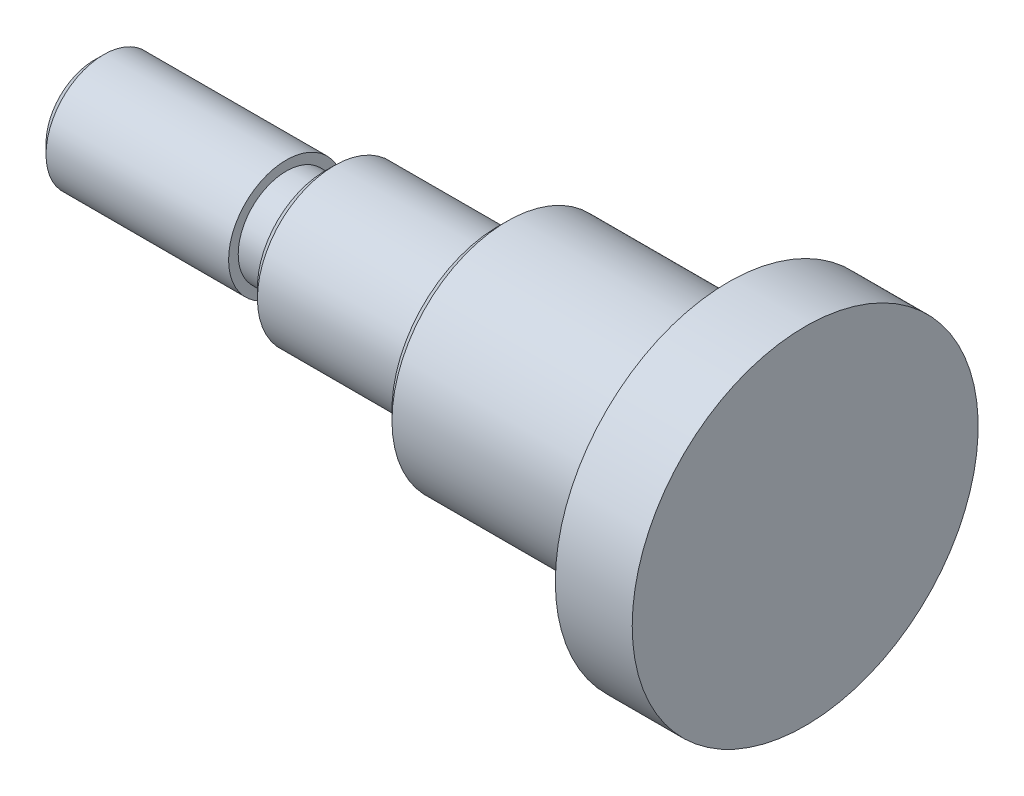
ISO-10303-21;
HEADER;
FILE_DESCRIPTION(('STEP AP214'),'2;1');
FILE_NAME('part.step','',(''),(''),'','','');
FILE_SCHEMA(('AUTOMOTIVE_DESIGN { 1 0 10303 214 1 1 1 1 }'));
ENDSEC;
DATA;
#1=APPLICATION_CONTEXT('core data for automotive mechanical design processes');
#2=APPLICATION_PROTOCOL_DEFINITION('international standard','automotive_design',2000,#1);
#3=PRODUCT_CONTEXT('',#1,'mechanical');
#4=PRODUCT('Part','Part','',(#3));
#5=PRODUCT_RELATED_PRODUCT_CATEGORY('part','',(#4));
#6=PRODUCT_DEFINITION_FORMATION('','',#4);
#7=PRODUCT_DEFINITION_CONTEXT('part definition',#1,'design');
#8=PRODUCT_DEFINITION('design','',#6,#7);
#9=PRODUCT_DEFINITION_SHAPE('','',#8);
#10=(LENGTH_UNIT() NAMED_UNIT(*) SI_UNIT(.MILLI.,.METRE.));
#11=(NAMED_UNIT(*) PLANE_ANGLE_UNIT() SI_UNIT($,.RADIAN.));
#12=(NAMED_UNIT(*) SI_UNIT($,.STERADIAN.) SOLID_ANGLE_UNIT());
#13=UNCERTAINTY_MEASURE_WITH_UNIT(LENGTH_MEASURE(1.E-05),#10,'distance_accuracy_value','');
#14=(GEOMETRIC_REPRESENTATION_CONTEXT(3) GLOBAL_UNCERTAINTY_ASSIGNED_CONTEXT((#13)) GLOBAL_UNIT_ASSIGNED_CONTEXT((#10,
#11,#12)) REPRESENTATION_CONTEXT('',''));
#15=CARTESIAN_POINT('',(0.,0.,0.));
#16=DIRECTION('',(0.,0.,1.));
#17=DIRECTION('',(1.,0.,0.));
#18=AXIS2_PLACEMENT_3D('',#15,#16,#17);
#19=CARTESIAN_POINT('',(0.,0.,0.));
#20=DIRECTION('',(-1.,0.,0.));
#21=DIRECTION('',(0.,0.,1.));
#22=AXIS2_PLACEMENT_3D('',#19,#20,#21);
#23=PLANE('',#22);
#24=CARTESIAN_POINT('',(0.,0.,0.));
#25=DIRECTION('',(-1.,0.,0.));
#26=DIRECTION('',(0.,0.,1.));
#27=AXIS2_PLACEMENT_3D('',#24,#25,#26);
#28=CIRCLE('',#27,9.);
#29=CARTESIAN_POINT('',(0.,0.,9.));
#30=VERTEX_POINT('',#29);
#31=EDGE_CURVE('E59',#30,#30,#28,.T.);
#32=ORIENTED_EDGE('',*,*,#31,.F.);
#33=EDGE_LOOP('',(#32));
#34=FACE_BOUND('',#33,.T.);
#35=ADVANCED_FACE('F33',(#34),#23,.F.);
#36=CARTESIAN_POINT('',(-37.,0.,0.));
#37=DIRECTION('',(-1.,0.,0.));
#38=DIRECTION('',(0.,0.,1.));
#39=AXIS2_PLACEMENT_3D('',#36,#37,#38);
#40=CYLINDRICAL_SURFACE('',#39,9.);
#41=CARTESIAN_POINT('',(-4.,0.,0.));
#42=DIRECTION('',(-1.,0.,0.));
#43=DIRECTION('',(0.,0.,1.));
#44=AXIS2_PLACEMENT_3D('',#41,#42,#43);
#45=CIRCLE('',#44,9.);
#46=CARTESIAN_POINT('',(-4.,0.,9.));
#47=VERTEX_POINT('',#46);
#48=EDGE_CURVE('E62',#47,#47,#45,.T.);
#49=ORIENTED_EDGE('',*,*,#48,.F.);
#50=EDGE_LOOP('',(#49));
#51=FACE_BOUND('',#50,.T.);
#52=ORIENTED_EDGE('',*,*,#31,.T.);
#53=EDGE_LOOP('',(#52));
#54=FACE_BOUND('',#53,.T.);
#55=ADVANCED_FACE('F105',(#51,#54),#40,.T.);
#56=CARTESIAN_POINT('',(-4.,9.,0.));
#57=DIRECTION('',(1.,0.,0.));
#58=DIRECTION('',(0.,0.,-1.));
#59=AXIS2_PLACEMENT_3D('',#56,#57,#58);
#60=PLANE('',#59);
#61=CARTESIAN_POINT('',(-4.,0.,0.));
#62=DIRECTION('',(-1.,0.,0.));
#63=DIRECTION('',(0.,0.,1.));
#64=AXIS2_PLACEMENT_3D('',#61,#62,#63);
#65=CIRCLE('',#64,6.);
#66=CARTESIAN_POINT('',(-4.,0.,6.));
#67=VERTEX_POINT('',#66);
#68=EDGE_CURVE('E65',#67,#67,#65,.T.);
#69=ORIENTED_EDGE('',*,*,#68,.F.);
#70=EDGE_LOOP('',(#69));
#71=FACE_BOUND('',#70,.T.);
#72=ORIENTED_EDGE('',*,*,#48,.T.);
#73=EDGE_LOOP('',(#72));
#74=FACE_BOUND('',#73,.T.);
#75=ADVANCED_FACE('F111',(#71,#74),#60,.F.);
#76=CARTESIAN_POINT('',(-37.,0.,0.));
#77=DIRECTION('',(-1.,0.,0.));
#78=DIRECTION('',(0.,0.,1.));
#79=AXIS2_PLACEMENT_3D('',#76,#77,#78);
#80=CYLINDRICAL_SURFACE('',#79,6.);
#81=CARTESIAN_POINT('',(-15.5,0.,0.));
#82=DIRECTION('',(1.,0.,0.));
#83=DIRECTION('',(0.,0.,-1.));
#84=AXIS2_PLACEMENT_3D('',#81,#82,#83);
#85=CIRCLE('',#84,6.);
#86=CARTESIAN_POINT('',(-15.5,0.,-6.));
#87=VERTEX_POINT('',#86);
#88=EDGE_CURVE('E44',#87,#87,#85,.T.);
#89=ORIENTED_EDGE('',*,*,#88,.T.);
#90=EDGE_LOOP('',(#89));
#91=FACE_BOUND('',#90,.T.);
#92=ORIENTED_EDGE('',*,*,#68,.T.);
#93=EDGE_LOOP('',(#92));
#94=FACE_BOUND('',#93,.T.);
#95=ADVANCED_FACE('F134',(#91,#94),#80,.T.);
#96=CARTESIAN_POINT('',(-16.,6.,0.));
#97=DIRECTION('',(1.,0.,0.));
#98=DIRECTION('',(0.,0.,-1.));
#99=AXIS2_PLACEMENT_3D('',#96,#97,#98);
#100=PLANE('',#99);
#101=CARTESIAN_POINT('',(-16.,0.,0.));
#102=DIRECTION('',(1.,0.,0.));
#103=DIRECTION('',(0.,0.,-1.));
#104=AXIS2_PLACEMENT_3D('',#101,#102,#103);
#105=CIRCLE('',#104,5.50000000000001);
#106=CARTESIAN_POINT('',(-16.,0.,-5.50000000000001));
#107=VERTEX_POINT('',#106);
#108=EDGE_CURVE('E48',#107,#107,#105,.F.);
#109=ORIENTED_EDGE('',*,*,#108,.T.);
#110=EDGE_LOOP('',(#109));
#111=FACE_BOUND('',#110,.T.);
#112=CARTESIAN_POINT('',(-16.,0.,0.));
#113=DIRECTION('',(-1.,0.,0.));
#114=DIRECTION('',(0.,0.,1.));
#115=AXIS2_PLACEMENT_3D('',#112,#113,#114);
#116=CIRCLE('',#115,4.);
#117=CARTESIAN_POINT('',(-16.,0.,4.));
#118=VERTEX_POINT('',#117);
#119=EDGE_CURVE('E68',#118,#118,#116,.T.);
#120=ORIENTED_EDGE('',*,*,#119,.F.);
#121=EDGE_LOOP('',(#120));
#122=FACE_BOUND('',#121,.T.);
#123=ADVANCED_FACE('F102',(#111,#122),#100,.F.);
#124=CARTESIAN_POINT('',(-37.,0.,0.));
#125=DIRECTION('',(-1.,0.,0.));
#126=DIRECTION('',(0.,0.,1.));
#127=AXIS2_PLACEMENT_3D('',#124,#125,#126);
#128=CYLINDRICAL_SURFACE('',#127,4.);
#129=CARTESIAN_POINT('',(-24.5,0.,0.));
#130=DIRECTION('',(1.,0.,0.));
#131=DIRECTION('',(0.,0.,-1.));
#132=AXIS2_PLACEMENT_3D('',#129,#130,#131);
#133=CIRCLE('',#132,4.);
#134=CARTESIAN_POINT('',(-24.5,0.,-4.));
#135=VERTEX_POINT('',#134);
#136=EDGE_CURVE('E10',#135,#135,#133,.T.);
#137=ORIENTED_EDGE('',*,*,#136,.T.);
#138=EDGE_LOOP('',(#137));
#139=FACE_BOUND('',#138,.T.);
#140=ORIENTED_EDGE('',*,*,#119,.T.);
#141=EDGE_LOOP('',(#140));
#142=FACE_BOUND('',#141,.T.);
#143=ADVANCED_FACE('F97',(#139,#142),#128,.T.);
#144=CARTESIAN_POINT('',(-25.,3.,0.));
#145=DIRECTION('',(1.,0.,0.));
#146=DIRECTION('',(0.,0.,-1.));
#147=AXIS2_PLACEMENT_3D('',#144,#145,#146);
#148=PLANE('',#147);
#149=CARTESIAN_POINT('',(-25.,0.,0.));
#150=DIRECTION('',(1.,0.,0.));
#151=DIRECTION('',(0.,0.,-1.));
#152=AXIS2_PLACEMENT_3D('',#149,#150,#151);
#153=CIRCLE('',#152,3.5);
#154=CARTESIAN_POINT('',(-25.,0.,-3.5));
#155=VERTEX_POINT('',#154);
#156=EDGE_CURVE('E40',#155,#155,#153,.F.);
#157=ORIENTED_EDGE('',*,*,#156,.T.);
#158=EDGE_LOOP('',(#157));
#159=FACE_BOUND('',#158,.T.);
#160=CARTESIAN_POINT('',(-25.,0.,0.));
#161=DIRECTION('',(-1.,0.,0.));
#162=DIRECTION('',(0.,0.,1.));
#163=AXIS2_PLACEMENT_3D('',#160,#161,#162);
#164=CIRCLE('',#163,2.5);
#165=CARTESIAN_POINT('',(-25.,0.,2.5));
#166=VERTEX_POINT('',#165);
#167=EDGE_CURVE('E71',#166,#166,#164,.T.);
#168=ORIENTED_EDGE('',*,*,#167,.F.);
#169=EDGE_LOOP('',(#168));
#170=FACE_BOUND('',#169,.T.);
#171=ADVANCED_FACE('F92',(#159,#170),#148,.F.);
#172=CARTESIAN_POINT('',(-37.,0.,0.));
#173=DIRECTION('',(-1.,0.,0.));
#174=DIRECTION('',(0.,0.,1.));
#175=AXIS2_PLACEMENT_3D('',#172,#173,#174);
#176=CYLINDRICAL_SURFACE('',#175,2.5);
#177=CARTESIAN_POINT('',(-27.,0.,0.));
#178=DIRECTION('',(-1.,0.,0.));
#179=DIRECTION('',(0.,0.,1.));
#180=AXIS2_PLACEMENT_3D('',#177,#178,#179);
#181=CIRCLE('',#180,2.5);
#182=CARTESIAN_POINT('',(-27.,0.,2.5));
#183=VERTEX_POINT('',#182);
#184=EDGE_CURVE('E74',#183,#183,#181,.T.);
#185=ORIENTED_EDGE('',*,*,#184,.F.);
#186=EDGE_LOOP('',(#185));
#187=FACE_BOUND('',#186,.T.);
#188=ORIENTED_EDGE('',*,*,#167,.T.);
#189=EDGE_LOOP('',(#188));
#190=FACE_BOUND('',#189,.T.);
#191=ADVANCED_FACE('F86',(#187,#190),#176,.T.);
#192=CARTESIAN_POINT('',(-27.,2.5,0.));
#193=DIRECTION('',(-1.,0.,0.));
#194=DIRECTION('',(0.,0.,1.));
#195=AXIS2_PLACEMENT_3D('',#192,#193,#194);
#196=PLANE('',#195);
#197=CARTESIAN_POINT('',(-27.,0.,0.));
#198=DIRECTION('',(-1.,0.,0.));
#199=DIRECTION('',(0.,0.,1.));
#200=AXIS2_PLACEMENT_3D('',#197,#198,#199);
#201=CIRCLE('',#200,3.);
#202=CARTESIAN_POINT('',(-27.,0.,3.));
#203=VERTEX_POINT('',#202);
#204=EDGE_CURVE('E77',#203,#203,#201,.T.);
#205=ORIENTED_EDGE('',*,*,#204,.F.);
#206=EDGE_LOOP('',(#205));
#207=FACE_BOUND('',#206,.T.);
#208=ORIENTED_EDGE('',*,*,#184,.T.);
#209=EDGE_LOOP('',(#208));
#210=FACE_BOUND('',#209,.T.);
#211=ADVANCED_FACE('F83',(#207,#210),#196,.F.);
#212=CARTESIAN_POINT('',(-37.,0.,0.));
#213=DIRECTION('',(-1.,0.,0.));
#214=DIRECTION('',(0.,0.,1.));
#215=AXIS2_PLACEMENT_3D('',#212,#213,#214);
#216=CYLINDRICAL_SURFACE('',#215,3.);
#217=CARTESIAN_POINT('',(-36.5,0.,0.));
#218=DIRECTION('',(1.,0.,0.));
#219=DIRECTION('',(0.,0.,-1.));
#220=AXIS2_PLACEMENT_3D('',#217,#218,#219);
#221=CIRCLE('',#220,3.);
#222=CARTESIAN_POINT('',(-36.5,0.,-3.));
#223=VERTEX_POINT('',#222);
#224=EDGE_CURVE('E53',#223,#223,#221,.T.);
#225=ORIENTED_EDGE('',*,*,#224,.T.);
#226=EDGE_LOOP('',(#225));
#227=FACE_BOUND('',#226,.T.);
#228=ORIENTED_EDGE('',*,*,#204,.T.);
#229=EDGE_LOOP('',(#228));
#230=FACE_BOUND('',#229,.T.);
#231=ADVANCED_FACE('F81',(#227,#230),#216,.T.);
#232=CARTESIAN_POINT('',(-37.,3.,0.));
#233=DIRECTION('',(1.,0.,0.));
#234=DIRECTION('',(0.,0.,-1.));
#235=AXIS2_PLACEMENT_3D('',#232,#233,#234);
#236=PLANE('',#235);
#237=CARTESIAN_POINT('',(-37.,0.,0.));
#238=DIRECTION('',(1.,0.,0.));
#239=DIRECTION('',(0.,0.,-1.));
#240=AXIS2_PLACEMENT_3D('',#237,#238,#239);
#241=CIRCLE('',#240,2.49999999999999);
#242=CARTESIAN_POINT('',(-37.,0.,-2.49999999999999));
#243=VERTEX_POINT('',#242);
#244=EDGE_CURVE('E56',#243,#243,#241,.F.);
#245=ORIENTED_EDGE('',*,*,#244,.T.);
#246=EDGE_LOOP('',(#245));
#247=FACE_BOUND('',#246,.T.);
#248=ADVANCED_FACE('F120',(#247),#236,.F.);
#249=CARTESIAN_POINT('',(-37.,0.,0.));
#250=DIRECTION('',(1.,0.,0.));
#251=DIRECTION('',(0.,0.,-1.));
#252=AXIS2_PLACEMENT_3D('',#249,#250,#251);
#253=CONICAL_SURFACE('',#252,2.49999999999999,0.785398163397452);
#254=ORIENTED_EDGE('',*,*,#224,.F.);
#255=EDGE_LOOP('',(#254));
#256=FACE_BOUND('',#255,.T.);
#257=ORIENTED_EDGE('',*,*,#244,.F.);
#258=EDGE_LOOP('',(#257));
#259=FACE_BOUND('',#258,.T.);
#260=ADVANCED_FACE('F117',(#256,#259),#253,.T.);
#261=CARTESIAN_POINT('',(-16.,0.,0.));
#262=DIRECTION('',(1.,0.,0.));
#263=DIRECTION('',(0.,0.,-1.));
#264=AXIS2_PLACEMENT_3D('',#261,#262,#263);
#265=CONICAL_SURFACE('',#264,5.50000000000001,0.785398163397449);
#266=ORIENTED_EDGE('',*,*,#88,.F.);
#267=EDGE_LOOP('',(#266));
#268=FACE_BOUND('',#267,.T.);
#269=ORIENTED_EDGE('',*,*,#108,.F.);
#270=EDGE_LOOP('',(#269));
#271=FACE_BOUND('',#270,.T.);
#272=ADVANCED_FACE('F119',(#268,#271),#265,.T.);
#273=CARTESIAN_POINT('',(-25.,0.,0.));
#274=DIRECTION('',(1.,0.,0.));
#275=DIRECTION('',(0.,0.,-1.));
#276=AXIS2_PLACEMENT_3D('',#273,#274,#275);
#277=CONICAL_SURFACE('',#276,3.5,0.785398163397448);
#278=ORIENTED_EDGE('',*,*,#136,.F.);
#279=EDGE_LOOP('',(#278));
#280=FACE_BOUND('',#279,.T.);
#281=ORIENTED_EDGE('',*,*,#156,.F.);
#282=EDGE_LOOP('',(#281));
#283=FACE_BOUND('',#282,.T.);
#284=ADVANCED_FACE('F35',(#280,#283),#277,.T.);
#285=CLOSED_SHELL('',(#35,#55,#75,#95,#123,#143,#171,#191,#211,#231,#248,#260,#272,#284));
#286=MANIFOLD_SOLID_BREP('B2',#285);
#287=ADVANCED_BREP_SHAPE_REPRESENTATION('',(#18,#286),#14);
#288=SHAPE_DEFINITION_REPRESENTATION(#9,#287);
ENDSEC;
END-ISO-10303-21;
